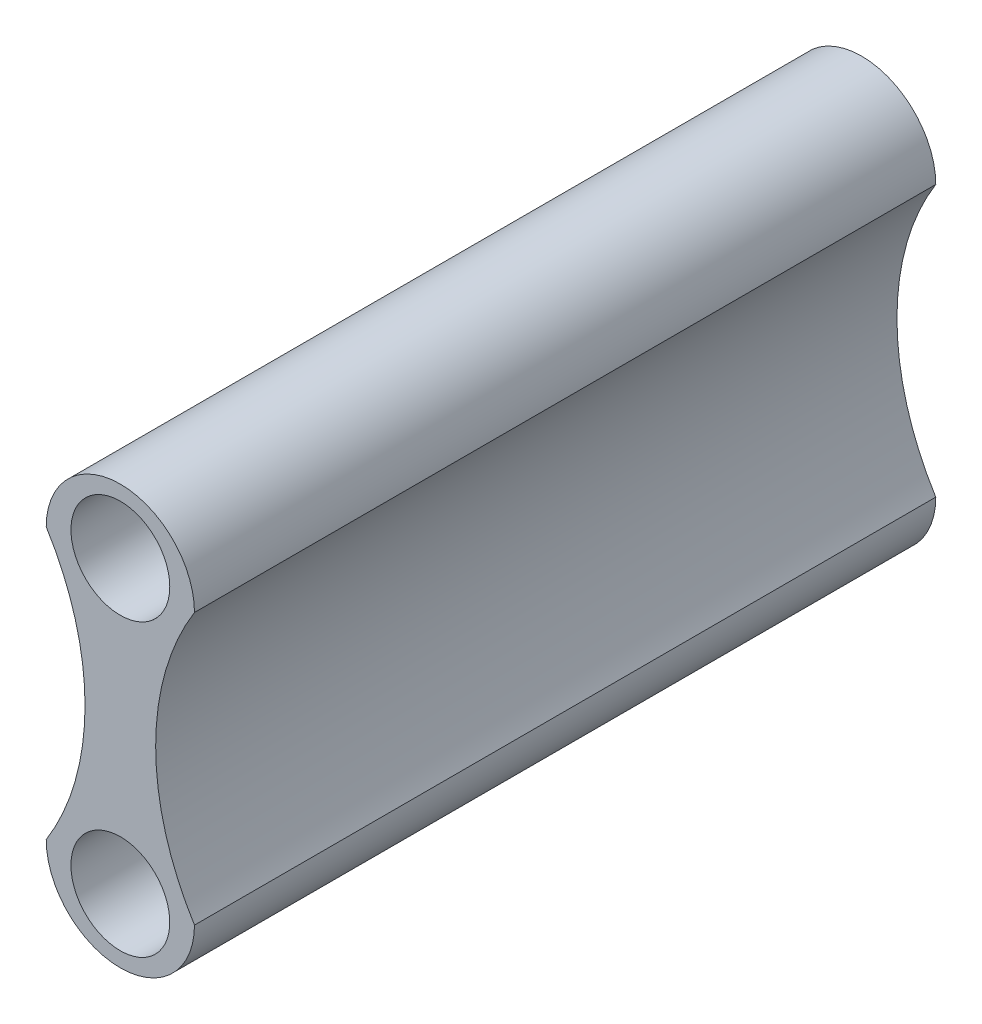
ISO-10303-21;
HEADER;
FILE_DESCRIPTION(('STEP AP214'),'2;1');
FILE_NAME('part.step','',(''),(''),'','','');
FILE_SCHEMA(('AUTOMOTIVE_DESIGN { 1 0 10303 214 1 1 1 1 }'));
ENDSEC;
DATA;
#1=APPLICATION_CONTEXT('core data for automotive mechanical design processes');
#2=APPLICATION_PROTOCOL_DEFINITION('international standard','automotive_design',2000,#1);
#3=PRODUCT_CONTEXT('',#1,'mechanical');
#4=PRODUCT('Part','Part','',(#3));
#5=PRODUCT_RELATED_PRODUCT_CATEGORY('part','',(#4));
#6=PRODUCT_DEFINITION_FORMATION('','',#4);
#7=PRODUCT_DEFINITION_CONTEXT('part definition',#1,'design');
#8=PRODUCT_DEFINITION('design','',#6,#7);
#9=PRODUCT_DEFINITION_SHAPE('','',#8);
#10=(LENGTH_UNIT() NAMED_UNIT(*) SI_UNIT(.MILLI.,.METRE.));
#11=(NAMED_UNIT(*) PLANE_ANGLE_UNIT() SI_UNIT($,.RADIAN.));
#12=(NAMED_UNIT(*) SI_UNIT($,.STERADIAN.) SOLID_ANGLE_UNIT());
#13=UNCERTAINTY_MEASURE_WITH_UNIT(LENGTH_MEASURE(1.E-05),#10,'distance_accuracy_value','');
#14=(GEOMETRIC_REPRESENTATION_CONTEXT(3) GLOBAL_UNCERTAINTY_ASSIGNED_CONTEXT((#13)) GLOBAL_UNIT_ASSIGNED_CONTEXT((#10,
#11,#12)) REPRESENTATION_CONTEXT('',''));
#15=CARTESIAN_POINT('',(0.,0.,0.));
#16=DIRECTION('',(0.,0.,1.));
#17=DIRECTION('',(1.,0.,0.));
#18=AXIS2_PLACEMENT_3D('',#15,#16,#17);
#19=CARTESIAN_POINT('',(5.88459194208376,-2.7393892570086,15.));
#20=DIRECTION('',(0.,0.,-1.));
#21=DIRECTION('',(-1.,0.,0.));
#22=AXIS2_PLACEMENT_3D('',#19,#20,#21);
#23=CYLINDRICAL_SURFACE('',#22,5.17);
#24=CARTESIAN_POINT('',(5.88459194208376,-2.7393892570086,0.));
#25=DIRECTION('',(0.,0.,-1.));
#26=DIRECTION('',(1.,0.,0.));
#27=AXIS2_PLACEMENT_3D('',#24,#25,#26);
#28=CIRCLE('',#27,5.17);
#29=CARTESIAN_POINT('',(1.5,-5.47877851401721,0.));
#30=VERTEX_POINT('',#29);
#31=CARTESIAN_POINT('',(1.5,0.,0.));
#32=VERTEX_POINT('',#31);
#33=EDGE_CURVE('E96',#30,#32,#28,.T.);
#34=ORIENTED_EDGE('',*,*,#33,.T.);
#35=DIRECTION('',(0.,0.,-1.));
#36=VECTOR('',#35,1.);
#37=CARTESIAN_POINT('',(1.5,0.,15.));
#38=LINE('',#37,#36);
#39=CARTESIAN_POINT('',(1.5,0.,15.));
#40=VERTEX_POINT('',#39);
#41=EDGE_CURVE('E11',#40,#32,#38,.T.);
#42=ORIENTED_EDGE('',*,*,#41,.F.);
#43=CARTESIAN_POINT('',(5.88459194208376,-2.7393892570086,15.));
#44=DIRECTION('',(0.,0.,-1.));
#45=DIRECTION('',(1.,0.,0.));
#46=AXIS2_PLACEMENT_3D('',#43,#44,#45);
#47=CIRCLE('',#46,5.17);
#48=CARTESIAN_POINT('',(1.5,-5.47877851401721,15.));
#49=VERTEX_POINT('',#48);
#50=EDGE_CURVE('E84',#49,#40,#47,.T.);
#51=ORIENTED_EDGE('',*,*,#50,.F.);
#52=DIRECTION('',(0.,0.,-1.));
#53=VECTOR('',#52,1.);
#54=CARTESIAN_POINT('',(1.5,-5.47877851401721,15.));
#55=LINE('',#54,#53);
#56=EDGE_CURVE('E92',#49,#30,#55,.T.);
#57=ORIENTED_EDGE('',*,*,#56,.T.);
#58=EDGE_LOOP('',(#34,#42,#51,#57));
#59=FACE_BOUND('',#58,.T.);
#60=ADVANCED_FACE('F33',(#59),#23,.F.);
#61=CARTESIAN_POINT('',(0.,0.,15.));
#62=DIRECTION('',(0.,0.,-1.));
#63=DIRECTION('',(-1.,0.,0.));
#64=AXIS2_PLACEMENT_3D('',#61,#62,#63);
#65=CYLINDRICAL_SURFACE('',#64,1.5);
#66=CARTESIAN_POINT('',(0.,0.,0.));
#67=DIRECTION('',(0.,0.,1.));
#68=DIRECTION('',(1.,0.,0.));
#69=AXIS2_PLACEMENT_3D('',#66,#67,#68);
#70=CIRCLE('',#69,1.5);
#71=CARTESIAN_POINT('',(-1.5,0.,0.));
#72=VERTEX_POINT('',#71);
#73=EDGE_CURVE('E88',#32,#72,#70,.T.);
#74=ORIENTED_EDGE('',*,*,#73,.T.);
#75=DIRECTION('',(0.,0.,-1.));
#76=VECTOR('',#75,1.);
#77=CARTESIAN_POINT('',(-1.5,0.,15.));
#78=LINE('',#77,#76);
#79=CARTESIAN_POINT('',(-1.5,0.,15.));
#80=VERTEX_POINT('',#79);
#81=EDGE_CURVE('E41',#80,#72,#78,.T.);
#82=ORIENTED_EDGE('',*,*,#81,.F.);
#83=CARTESIAN_POINT('',(0.,0.,15.));
#84=DIRECTION('',(0.,0.,1.));
#85=DIRECTION('',(1.,0.,0.));
#86=AXIS2_PLACEMENT_3D('',#83,#84,#85);
#87=CIRCLE('',#86,1.5);
#88=EDGE_CURVE('E79',#40,#80,#87,.T.);
#89=ORIENTED_EDGE('',*,*,#88,.F.);
#90=ORIENTED_EDGE('',*,*,#41,.T.);
#91=EDGE_LOOP('',(#74,#82,#89,#90));
#92=FACE_BOUND('',#91,.T.);
#93=ADVANCED_FACE('F87',(#92),#65,.T.);
#94=CARTESIAN_POINT('',(-5.88459194208377,-2.7393892570086,15.));
#95=DIRECTION('',(0.,0.,-1.));
#96=DIRECTION('',(-1.,0.,0.));
#97=AXIS2_PLACEMENT_3D('',#94,#95,#96);
#98=CYLINDRICAL_SURFACE('',#97,5.17);
#99=CARTESIAN_POINT('',(-5.88459194208377,-2.7393892570086,0.));
#100=DIRECTION('',(0.,0.,-1.));
#101=DIRECTION('',(-1.,0.,0.));
#102=AXIS2_PLACEMENT_3D('',#99,#100,#101);
#103=CIRCLE('',#102,5.17);
#104=CARTESIAN_POINT('',(-1.5,-5.4787785140172,0.));
#105=VERTEX_POINT('',#104);
#106=EDGE_CURVE('E66',#72,#105,#103,.T.);
#107=ORIENTED_EDGE('',*,*,#106,.T.);
#108=DIRECTION('',(0.,0.,-1.));
#109=VECTOR('',#108,1.);
#110=CARTESIAN_POINT('',(-1.5,-5.4787785140172,15.));
#111=LINE('',#110,#109);
#112=CARTESIAN_POINT('',(-1.5,-5.4787785140172,15.));
#113=VERTEX_POINT('',#112);
#114=EDGE_CURVE('E89',#113,#105,#111,.T.);
#115=ORIENTED_EDGE('',*,*,#114,.F.);
#116=CARTESIAN_POINT('',(-5.88459194208377,-2.7393892570086,15.));
#117=DIRECTION('',(0.,0.,-1.));
#118=DIRECTION('',(-1.,0.,0.));
#119=AXIS2_PLACEMENT_3D('',#116,#117,#118);
#120=CIRCLE('',#119,5.17);
#121=EDGE_CURVE('E82',#80,#113,#120,.T.);
#122=ORIENTED_EDGE('',*,*,#121,.F.);
#123=ORIENTED_EDGE('',*,*,#81,.T.);
#124=EDGE_LOOP('',(#107,#115,#122,#123));
#125=FACE_BOUND('',#124,.T.);
#126=ADVANCED_FACE('F90',(#125),#98,.F.);
#127=CARTESIAN_POINT('',(0.,-5.4787785140172,15.));
#128=DIRECTION('',(0.,0.,-1.));
#129=DIRECTION('',(-1.,0.,0.));
#130=AXIS2_PLACEMENT_3D('',#127,#128,#129);
#131=CYLINDRICAL_SURFACE('',#130,1.5);
#132=CARTESIAN_POINT('',(0.,-5.4787785140172,0.));
#133=DIRECTION('',(0.,0.,1.));
#134=DIRECTION('',(-1.,0.,0.));
#135=AXIS2_PLACEMENT_3D('',#132,#133,#134);
#136=CIRCLE('',#135,1.5);
#137=EDGE_CURVE('E72',#105,#30,#136,.T.);
#138=ORIENTED_EDGE('',*,*,#137,.T.);
#139=ORIENTED_EDGE('',*,*,#56,.F.);
#140=CARTESIAN_POINT('',(0.,-5.4787785140172,15.));
#141=DIRECTION('',(0.,0.,1.));
#142=DIRECTION('',(-1.,0.,0.));
#143=AXIS2_PLACEMENT_3D('',#140,#141,#142);
#144=CIRCLE('',#143,1.5);
#145=EDGE_CURVE('E49',#113,#49,#144,.T.);
#146=ORIENTED_EDGE('',*,*,#145,.F.);
#147=ORIENTED_EDGE('',*,*,#114,.T.);
#148=EDGE_LOOP('',(#138,#139,#146,#147));
#149=FACE_BOUND('',#148,.T.);
#150=ADVANCED_FACE('F104',(#149),#131,.T.);
#151=CARTESIAN_POINT('',(2.94229597104188,-4.1090838855129,15.));
#152=DIRECTION('',(0.,0.,1.));
#153=DIRECTION('',(1.,0.,0.));
#154=AXIS2_PLACEMENT_3D('',#151,#152,#153);
#155=PLANE('',#154);
#156=CARTESIAN_POINT('',(0.,0.2,15.));
#157=DIRECTION('',(0.,0.,1.));
#158=DIRECTION('',(1.,0.,0.));
#159=AXIS2_PLACEMENT_3D('',#156,#157,#158);
#160=CIRCLE('',#159,1.);
#161=CARTESIAN_POINT('',(1.,0.2,15.));
#162=VERTEX_POINT('',#161);
#163=EDGE_CURVE('E117',#162,#162,#160,.T.);
#164=ORIENTED_EDGE('',*,*,#163,.F.);
#165=EDGE_LOOP('',(#164));
#166=FACE_BOUND('',#165,.T.);
#167=CARTESIAN_POINT('',(0.,-5.6787785140172,15.));
#168=DIRECTION('',(0.,0.,1.));
#169=DIRECTION('',(-1.,0.,0.));
#170=AXIS2_PLACEMENT_3D('',#167,#168,#169);
#171=CIRCLE('',#170,1.);
#172=CARTESIAN_POINT('',(-0.999999999999997,-5.6787785140172,15.));
#173=VERTEX_POINT('',#172);
#174=EDGE_CURVE('E110',#173,#173,#171,.T.);
#175=ORIENTED_EDGE('',*,*,#174,.F.);
#176=EDGE_LOOP('',(#175));
#177=FACE_BOUND('',#176,.T.);
#178=ORIENTED_EDGE('',*,*,#50,.T.);
#179=ORIENTED_EDGE('',*,*,#88,.T.);
#180=ORIENTED_EDGE('',*,*,#121,.T.);
#181=ORIENTED_EDGE('',*,*,#145,.T.);
#182=EDGE_LOOP('',(#178,#179,#180,#181));
#183=FACE_BOUND('',#182,.T.);
#184=ADVANCED_FACE('F80',(#166,#177,#183),#155,.T.);
#185=CARTESIAN_POINT('',(2.94229597104188,-4.1090838855129,0.));
#186=DIRECTION('',(0.,0.,1.));
#187=DIRECTION('',(1.,0.,0.));
#188=AXIS2_PLACEMENT_3D('',#185,#186,#187);
#189=PLANE('',#188);
#190=CARTESIAN_POINT('',(0.,0.2,0.));
#191=DIRECTION('',(0.,0.,-1.));
#192=DIRECTION('',(-1.,0.,0.));
#193=AXIS2_PLACEMENT_3D('',#190,#191,#192);
#194=CIRCLE('',#193,1.);
#195=CARTESIAN_POINT('',(-1.,0.2,0.));
#196=VERTEX_POINT('',#195);
#197=EDGE_CURVE('E128',#196,#196,#194,.T.);
#198=ORIENTED_EDGE('',*,*,#197,.F.);
#199=EDGE_LOOP('',(#198));
#200=FACE_BOUND('',#199,.T.);
#201=CARTESIAN_POINT('',(0.,-5.6787785140172,0.));
#202=DIRECTION('',(0.,0.,-1.));
#203=DIRECTION('',(-1.,0.,0.));
#204=AXIS2_PLACEMENT_3D('',#201,#202,#203);
#205=CIRCLE('',#204,1.);
#206=CARTESIAN_POINT('',(-0.999999999999997,-5.6787785140172,0.));
#207=VERTEX_POINT('',#206);
#208=EDGE_CURVE('E122',#207,#207,#205,.T.);
#209=ORIENTED_EDGE('',*,*,#208,.F.);
#210=EDGE_LOOP('',(#209));
#211=FACE_BOUND('',#210,.T.);
#212=ORIENTED_EDGE('',*,*,#33,.F.);
#213=ORIENTED_EDGE('',*,*,#137,.F.);
#214=ORIENTED_EDGE('',*,*,#106,.F.);
#215=ORIENTED_EDGE('',*,*,#73,.F.);
#216=EDGE_LOOP('',(#212,#213,#214,#215));
#217=FACE_BOUND('',#216,.T.);
#218=ADVANCED_FACE('F107',(#200,#211,#217),#189,.F.);
#219=CARTESIAN_POINT('',(0.,-5.6787785140172,11.));
#220=DIRECTION('',(0.,0.,1.));
#221=DIRECTION('',(1.,0.,0.));
#222=AXIS2_PLACEMENT_3D('',#219,#220,#221);
#223=CYLINDRICAL_SURFACE('',#222,1.);
#224=CARTESIAN_POINT('',(0.,-5.6787785140172,11.));
#225=DIRECTION('',(0.,0.,1.));
#226=DIRECTION('',(-1.,0.,0.));
#227=AXIS2_PLACEMENT_3D('',#224,#225,#226);
#228=CIRCLE('',#227,1.);
#229=CARTESIAN_POINT('',(-0.999999999999997,-5.6787785140172,11.));
#230=VERTEX_POINT('',#229);
#231=EDGE_CURVE('E113',#230,#230,#228,.T.);
#232=ORIENTED_EDGE('',*,*,#231,.F.);
#233=EDGE_LOOP('',(#232));
#234=FACE_BOUND('',#233,.T.);
#235=ORIENTED_EDGE('',*,*,#174,.T.);
#236=EDGE_LOOP('',(#235));
#237=FACE_BOUND('',#236,.T.);
#238=ADVANCED_FACE('F145',(#234,#237),#223,.F.);
#239=CARTESIAN_POINT('',(0.,-5.6787785140172,11.));
#240=DIRECTION('',(0.,0.,-1.));
#241=DIRECTION('',(-1.,0.,0.));
#242=AXIS2_PLACEMENT_3D('',#239,#240,#241);
#243=PLANE('',#242);
#244=ORIENTED_EDGE('',*,*,#231,.T.);
#245=EDGE_LOOP('',(#244));
#246=FACE_BOUND('',#245,.T.);
#247=ADVANCED_FACE('F180',(#246),#243,.F.);
#248=CARTESIAN_POINT('',(0.,0.2,11.));
#249=DIRECTION('',(0.,0.,1.));
#250=DIRECTION('',(1.,0.,0.));
#251=AXIS2_PLACEMENT_3D('',#248,#249,#250);
#252=CYLINDRICAL_SURFACE('',#251,1.);
#253=CARTESIAN_POINT('',(0.,0.2,11.));
#254=DIRECTION('',(0.,0.,1.));
#255=DIRECTION('',(1.,0.,0.));
#256=AXIS2_PLACEMENT_3D('',#253,#254,#255);
#257=CIRCLE('',#256,1.);
#258=CARTESIAN_POINT('',(1.,0.2,11.));
#259=VERTEX_POINT('',#258);
#260=EDGE_CURVE('E99',#259,#259,#257,.T.);
#261=ORIENTED_EDGE('',*,*,#260,.F.);
#262=EDGE_LOOP('',(#261));
#263=FACE_BOUND('',#262,.T.);
#264=ORIENTED_EDGE('',*,*,#163,.T.);
#265=EDGE_LOOP('',(#264));
#266=FACE_BOUND('',#265,.T.);
#267=ADVANCED_FACE('F160',(#263,#266),#252,.F.);
#268=CARTESIAN_POINT('',(0.,0.2,11.));
#269=DIRECTION('',(0.,0.,1.));
#270=DIRECTION('',(1.,0.,0.));
#271=AXIS2_PLACEMENT_3D('',#268,#269,#270);
#272=PLANE('',#271);
#273=ORIENTED_EDGE('',*,*,#260,.T.);
#274=EDGE_LOOP('',(#273));
#275=FACE_BOUND('',#274,.T.);
#276=ADVANCED_FACE('F151',(#275),#272,.T.);
#277=CARTESIAN_POINT('',(0.,-5.6787785140172,4.));
#278=DIRECTION('',(0.,0.,-1.));
#279=DIRECTION('',(-1.,0.,0.));
#280=AXIS2_PLACEMENT_3D('',#277,#278,#279);
#281=CYLINDRICAL_SURFACE('',#280,1.);
#282=CARTESIAN_POINT('',(0.,-5.6787785140172,4.));
#283=DIRECTION('',(0.,0.,-1.));
#284=DIRECTION('',(-1.,0.,0.));
#285=AXIS2_PLACEMENT_3D('',#282,#283,#284);
#286=CIRCLE('',#285,1.);
#287=CARTESIAN_POINT('',(-0.999999999999997,-5.6787785140172,4.));
#288=VERTEX_POINT('',#287);
#289=EDGE_CURVE('E125',#288,#288,#286,.T.);
#290=ORIENTED_EDGE('',*,*,#289,.F.);
#291=EDGE_LOOP('',(#290));
#292=FACE_BOUND('',#291,.T.);
#293=ORIENTED_EDGE('',*,*,#208,.T.);
#294=EDGE_LOOP('',(#293));
#295=FACE_BOUND('',#294,.T.);
#296=ADVANCED_FACE('F149',(#292,#295),#281,.F.);
#297=CARTESIAN_POINT('',(0.,-5.6787785140172,4.));
#298=DIRECTION('',(0.,0.,-1.));
#299=DIRECTION('',(-1.,0.,0.));
#300=AXIS2_PLACEMENT_3D('',#297,#298,#299);
#301=PLANE('',#300);
#302=ORIENTED_EDGE('',*,*,#289,.T.);
#303=EDGE_LOOP('',(#302));
#304=FACE_BOUND('',#303,.T.);
#305=ADVANCED_FACE('F139',(#304),#301,.T.);
#306=CARTESIAN_POINT('',(0.,0.2,4.));
#307=DIRECTION('',(0.,0.,-1.));
#308=DIRECTION('',(-1.,0.,0.));
#309=AXIS2_PLACEMENT_3D('',#306,#307,#308);
#310=CYLINDRICAL_SURFACE('',#309,1.);
#311=CARTESIAN_POINT('',(0.,0.2,4.));
#312=DIRECTION('',(0.,0.,-1.));
#313=DIRECTION('',(-1.,0.,0.));
#314=AXIS2_PLACEMENT_3D('',#311,#312,#313);
#315=CIRCLE('',#314,1.);
#316=CARTESIAN_POINT('',(-1.,0.2,4.));
#317=VERTEX_POINT('',#316);
#318=EDGE_CURVE('E114',#317,#317,#315,.T.);
#319=ORIENTED_EDGE('',*,*,#318,.F.);
#320=EDGE_LOOP('',(#319));
#321=FACE_BOUND('',#320,.T.);
#322=ORIENTED_EDGE('',*,*,#197,.T.);
#323=EDGE_LOOP('',(#322));
#324=FACE_BOUND('',#323,.T.);
#325=ADVANCED_FACE('F136',(#321,#324),#310,.F.);
#326=CARTESIAN_POINT('',(0.,0.2,4.));
#327=DIRECTION('',(0.,0.,-1.));
#328=DIRECTION('',(-1.,0.,0.));
#329=AXIS2_PLACEMENT_3D('',#326,#327,#328);
#330=PLANE('',#329);
#331=ORIENTED_EDGE('',*,*,#318,.T.);
#332=EDGE_LOOP('',(#331));
#333=FACE_BOUND('',#332,.T.);
#334=ADVANCED_FACE('F134',(#333),#330,.T.);
#335=CLOSED_SHELL('',(#60,#93,#126,#150,#184,#218,#238,#247,#267,#276,#296,#305,#325,#334));
#336=MANIFOLD_SOLID_BREP('B2',#335);
#337=ADVANCED_BREP_SHAPE_REPRESENTATION('',(#18,#336),#14);
#338=SHAPE_DEFINITION_REPRESENTATION(#9,#337);
ENDSEC;
END-ISO-10303-21;
